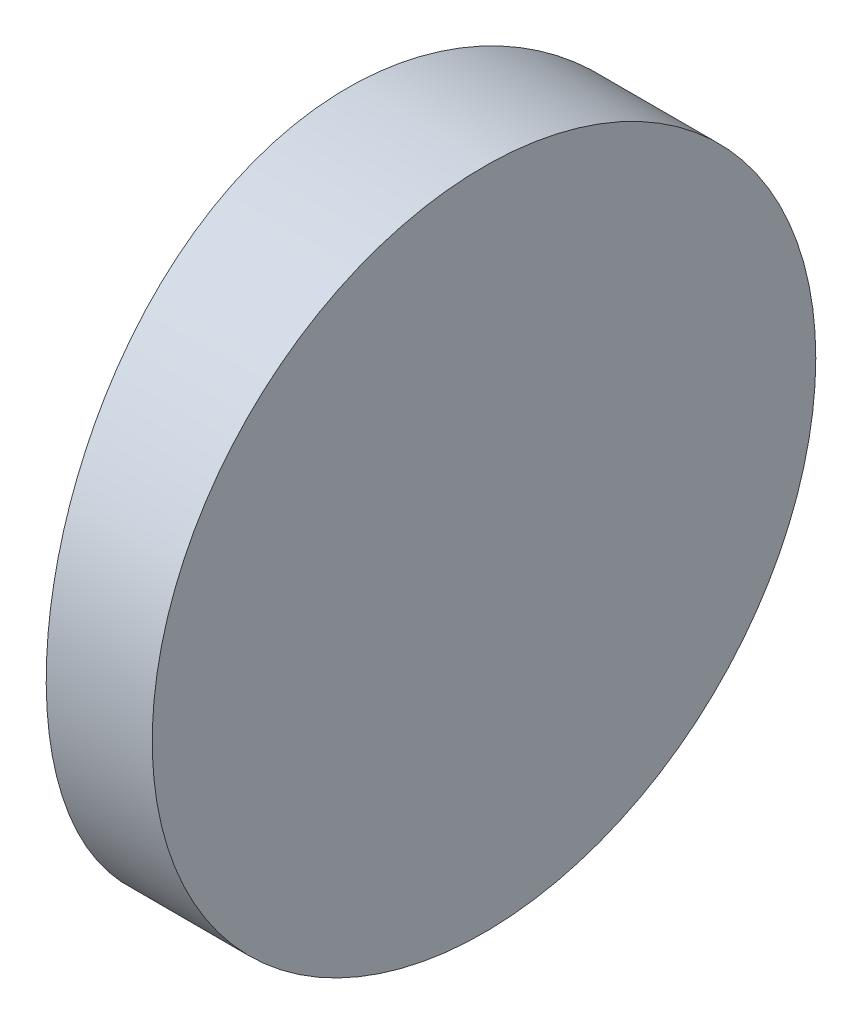
ISO-10303-21;
HEADER;
FILE_DESCRIPTION(('STEP AP214'),'2;1');
FILE_NAME('part.step','',(''),(''),'','','');
FILE_SCHEMA(('AUTOMOTIVE_DESIGN { 1 0 10303 214 1 1 1 1 }'));
ENDSEC;
DATA;
#1=APPLICATION_CONTEXT('core data for automotive mechanical design processes');
#2=APPLICATION_PROTOCOL_DEFINITION('international standard','automotive_design',2000,#1);
#3=PRODUCT_CONTEXT('',#1,'mechanical');
#4=PRODUCT('Part','Part','',(#3));
#5=PRODUCT_RELATED_PRODUCT_CATEGORY('part','',(#4));
#6=PRODUCT_DEFINITION_FORMATION('','',#4);
#7=PRODUCT_DEFINITION_CONTEXT('part definition',#1,'design');
#8=PRODUCT_DEFINITION('design','',#6,#7);
#9=PRODUCT_DEFINITION_SHAPE('','',#8);
#10=(LENGTH_UNIT() NAMED_UNIT(*) SI_UNIT(.MILLI.,.METRE.));
#11=(NAMED_UNIT(*) PLANE_ANGLE_UNIT() SI_UNIT($,.RADIAN.));
#12=(NAMED_UNIT(*) SI_UNIT($,.STERADIAN.) SOLID_ANGLE_UNIT());
#13=UNCERTAINTY_MEASURE_WITH_UNIT(LENGTH_MEASURE(1.E-05),#10,'distance_accuracy_value','');
#14=(GEOMETRIC_REPRESENTATION_CONTEXT(3) GLOBAL_UNCERTAINTY_ASSIGNED_CONTEXT((#13)) GLOBAL_UNIT_ASSIGNED_CONTEXT((#10,
#11,#12)) REPRESENTATION_CONTEXT('',''));
#15=CARTESIAN_POINT('',(0.,0.,0.));
#16=DIRECTION('',(0.,0.,1.));
#17=DIRECTION('',(1.,0.,0.));
#18=AXIS2_PLACEMENT_3D('',#15,#16,#17);
#19=CARTESIAN_POINT('',(4.35520433485127,12.5,0.));
#20=DIRECTION('',(0.,-1.,0.));
#21=DIRECTION('',(0.,0.,-1.));
#22=AXIS2_PLACEMENT_3D('',#19,#20,#21);
#23=CYLINDRICAL_SURFACE('',#22,34.3800000000001);
#24=CARTESIAN_POINT('',(-30.0247956651488,0.,0.));
#25=CARTESIAN_POINT('',(-30.0247966754529,-2.16526707216863E-06,-0.174032121800616));
#26=CARTESIAN_POINT('',(-30.0234716706296,0.00727166692268643,-0.348033690944135));
#27=CARTESIAN_POINT('',(-30.0182106574276,0.0363076365460484,-0.694838989285588));
#28=CARTESIAN_POINT('',(-30.0142740651669,0.0580730139107357,-0.867642441884459));
#29=CARTESIAN_POINT('',(-30.0038946533762,0.115948332313473,-1.21087872715717));
#30=CARTESIAN_POINT('',(-29.9974500023495,0.152068756458872,-1.38130973294414));
#31=CARTESIAN_POINT('',(-29.9822323237955,0.23838950915103,-1.71852880902783));
#32=CARTESIAN_POINT('',(-29.9734584366653,0.288595036184187,-1.88531550975134));
#33=CARTESIAN_POINT('',(-29.9538405518825,0.402623799255349,-2.21379261973112));
#34=CARTESIAN_POINT('',(-29.9429992927213,0.466429033805725,-2.37548944470005));
#35=CARTESIAN_POINT('',(-29.9195342728976,0.607250175725587,-2.69296132429321));
#36=CARTESIAN_POINT('',(-29.9069098462301,0.684271021385642,-2.84873413860882));
#37=CARTESIAN_POINT('',(-29.8802364754772,0.850901583755614,-3.15314558451637));
#38=CARTESIAN_POINT('',(-29.8661883700975,0.940503900432328,-3.30178834133201));
#39=CARTESIAN_POINT('',(-29.8370391089744,1.13174413209563,-3.59110574690427));
#40=CARTESIAN_POINT('',(-29.8219374758049,1.23338751847757,-3.73177673007921));
#41=CARTESIAN_POINT('',(-29.7909443199645,1.44905570359173,-4.00550844840688));
#42=CARTESIAN_POINT('',(-29.7750463901435,1.56319454311513,-4.13847861978909));
#43=CARTESIAN_POINT('',(-29.7430528478512,1.80216308204326,-4.39429986610319));
#44=CARTESIAN_POINT('',(-29.7269573256952,1.92698804227052,-4.51715537983779));
#45=CARTESIAN_POINT('',(-29.6949999474501,2.18661291141819,-4.75205769627394));
#46=CARTESIAN_POINT('',(-29.67913826192,2.32141970742477,-4.86409691101038));
#47=CARTESIAN_POINT('',(-29.6481119774946,2.59996367494434,-5.07645489294219));
#48=CARTESIAN_POINT('',(-29.6329471198384,2.74369748409176,-5.17677803248602));
#49=CARTESIAN_POINT('',(-29.6036175208395,3.04038236977081,-5.36582215189747));
#50=CARTESIAN_POINT('',(-29.5894620406244,3.19339958540813,-5.45444081888822));
#51=CARTESIAN_POINT('',(-29.5627070667163,3.50643985243101,-5.61841506640609));
#52=CARTESIAN_POINT('',(-29.5501069954021,3.66646027300101,-5.69377557496905));
#53=CARTESIAN_POINT('',(-29.5268368577649,3.99230413100608,-5.83065230380131));
#54=CARTESIAN_POINT('',(-29.5161652271573,4.15812273364641,-5.89217975495147));
#55=CARTESIAN_POINT('',(-29.49705850374,4.49443844016161,-6.00097855035523));
#56=CARTESIAN_POINT('',(-29.4886228646966,4.66493439014887,-6.04825337679211));
#57=CARTESIAN_POINT('',(-29.4717783258182,5.06841981588443,-6.14187845947594));
#58=CARTESIAN_POINT('',(-29.4643659423319,5.30283360074904,-6.18237901216096));
#59=CARTESIAN_POINT('',(-29.4544393592717,5.77485060915913,-6.23643807294721));
#60=CARTESIAN_POINT('',(-29.4519250767577,6.01245377862978,-6.24999703725363));
#61=CARTESIAN_POINT('',(-29.4519225386692,6.42400541758091,-6.25000217024676));
#62=CARTESIAN_POINT('',(-29.4532697770657,6.59798027831555,-6.24273054816984));
#63=CARTESIAN_POINT('',(-29.4586170461026,6.94473143297194,-6.21370362390689));
#64=CARTESIAN_POINT('',(-29.4626176705784,7.11750744984051,-6.19194507950131));
#65=CARTESIAN_POINT('',(-29.4731597847823,7.46068823321553,-6.1340884563267));
#66=CARTESIAN_POINT('',(-29.4797031382219,7.63109116523722,-6.09797985914068));
#67=CARTESIAN_POINT('',(-29.4951416617448,7.96825348377027,-6.0116882927916));
#68=CARTESIAN_POINT('',(-29.5040377009796,8.13501149904221,-5.96150012180162));
#69=CARTESIAN_POINT('',(-29.5239091085365,8.46342760203223,-5.84751325724086));
#70=CARTESIAN_POINT('',(-29.5348816717895,8.62509223040447,-5.78373291015062));
#71=CARTESIAN_POINT('',(-29.5586042044396,8.94250242573575,-5.6429675937343));
#72=CARTESIAN_POINT('',(-29.5713548380792,9.09824575284527,-5.56597768716045));
#73=CARTESIAN_POINT('',(-29.5982644567942,9.40263721903731,-5.39939524591703));
#74=CARTESIAN_POINT('',(-29.6124229309107,9.55128790353262,-5.30980727870906));
#75=CARTESIAN_POINT('',(-29.641755969186,9.84055970999452,-5.11863634783181));
#76=CARTESIAN_POINT('',(-29.6569305460109,9.98118073182725,-5.01705323462559));
#77=CARTESIAN_POINT('',(-29.6880399519737,10.2549058633713,-4.80144805538986));
#78=CARTESIAN_POINT('',(-29.7039811521704,10.3879140763228,-4.68730514185814));
#79=CARTESIAN_POINT('',(-29.7360169652237,10.6438117306277,-4.4483204393805));
#80=CARTESIAN_POINT('',(-29.7521115072655,10.7667056120484,-4.32348339467767));
#81=CARTESIAN_POINT('',(-29.7840228124085,11.0016831370688,-4.06382666333918));
#82=CARTESIAN_POINT('',(-29.7998393756431,11.1137592434572,-3.92900013057043));
#83=CARTESIAN_POINT('',(-29.8307364007761,11.3261881941602,-3.65040914334591));
#84=CARTESIAN_POINT('',(-29.8458171364066,11.4265454176248,-3.5066480585515));
#85=CARTESIAN_POINT('',(-29.8749442220342,11.6156285534217,-3.20994109758478));
#86=CARTESIAN_POINT('',(-29.888981370532,11.7042553945702,-3.05693115314029));
#87=CARTESIAN_POINT('',(-29.9154835537917,11.8682467437598,-2.74390468318712));
#88=CARTESIAN_POINT('',(-29.927949172124,11.9436161789258,-2.58389078843104));
#89=CARTESIAN_POINT('',(-29.9509497257062,12.0805112246906,-2.25806001828833));
#90=CARTESIAN_POINT('',(-29.9614862184638,12.1420480125043,-2.09224795411832));
#91=CARTESIAN_POINT('',(-29.9803373883054,12.25086569886,-1.75594687598187));
#92=CARTESIAN_POINT('',(-29.9886526065797,12.2981500702149,-1.58545901240735));
#93=CARTESIAN_POINT('',(-30.005252136405,12.3918167011583,-1.18191569936069));
#94=CARTESIAN_POINT('',(-30.0125499722774,12.4323405433149,-0.947434528036667));
#95=CARTESIAN_POINT('',(-30.022321008445,12.4864304994547,-0.475283218873991));
#96=CARTESIAN_POINT('',(-30.0247942857395,12.4999970436728,-0.237613131990956));
#97=CARTESIAN_POINT('',(-30.0247966754529,12.5000021652671,0.174032121800623));
#98=CARTESIAN_POINT('',(-30.0234716706296,12.4927283330773,0.34803369094414));
#99=CARTESIAN_POINT('',(-30.0182106574276,12.463692363454,0.694838989285593));
#100=CARTESIAN_POINT('',(-30.0142740651669,12.4419269860893,0.867642441884465));
#101=CARTESIAN_POINT('',(-30.0038946533762,12.3840516676865,1.21087872715718));
#102=CARTESIAN_POINT('',(-29.9974500023495,12.3479312435411,1.38130973294415));
#103=CARTESIAN_POINT('',(-29.9822323237955,12.261610490849,1.71852880902784));
#104=CARTESIAN_POINT('',(-29.9734584366653,12.2114049638158,1.88531550975135));
#105=CARTESIAN_POINT('',(-29.9538405518825,12.0973762007447,2.21379261973113));
#106=CARTESIAN_POINT('',(-29.9429992927213,12.0335709661943,2.37548944470005));
#107=CARTESIAN_POINT('',(-29.9195342728976,11.8927498242744,2.69296132429321));
#108=CARTESIAN_POINT('',(-29.9069098462301,11.8157289786144,2.84873413860883));
#109=CARTESIAN_POINT('',(-29.8802364754772,11.6490984162444,3.15314558451638));
#110=CARTESIAN_POINT('',(-29.8661883700975,11.5594960995677,3.30178834133202));
#111=CARTESIAN_POINT('',(-29.8370391089744,11.3682558679044,3.59110574690427));
#112=CARTESIAN_POINT('',(-29.8219374758049,11.2666124815224,3.73177673007922));
#113=CARTESIAN_POINT('',(-29.7909443199645,11.0509442964083,4.00550844840689));
#114=CARTESIAN_POINT('',(-29.7750463901435,10.9368054568849,4.13847861978909));
#115=CARTESIAN_POINT('',(-29.7430528478512,10.6978369179567,4.3942998661032));
#116=CARTESIAN_POINT('',(-29.7269573256952,10.5730119577295,4.5171553798378));
#117=CARTESIAN_POINT('',(-29.6949999474501,10.3133870885818,4.75205769627395));
#118=CARTESIAN_POINT('',(-29.67913826192,10.1785802925752,4.86409691101038));
#119=CARTESIAN_POINT('',(-29.6481119774946,9.90003632505566,5.07645489294219));
#120=CARTESIAN_POINT('',(-29.6329471198384,9.75630251590824,5.17677803248602));
#121=CARTESIAN_POINT('',(-29.6036175208395,9.45961763022919,5.36582215189748));
#122=CARTESIAN_POINT('',(-29.5894620406244,9.30660041459188,5.45444081888823));
#123=CARTESIAN_POINT('',(-29.5627070667163,8.993560147569,5.6184150664061));
#124=CARTESIAN_POINT('',(-29.5501069954021,8.833539726999,5.69377557496906));
#125=CARTESIAN_POINT('',(-29.5268368577649,8.50769586899392,5.83065230380132));
#126=CARTESIAN_POINT('',(-29.5161652271573,8.34187726635359,5.89217975495148));
#127=CARTESIAN_POINT('',(-29.49705850374,8.00556155983839,6.00097855035524));
#128=CARTESIAN_POINT('',(-29.4886228646966,7.83506560985114,6.04825337679211));
#129=CARTESIAN_POINT('',(-29.4717783258182,7.43158018411557,6.14187845947595));
#130=CARTESIAN_POINT('',(-29.4643659423319,7.19716639925096,6.18237901216097));
#131=CARTESIAN_POINT('',(-29.4544393592717,6.72514939084087,6.23643807294722));
#132=CARTESIAN_POINT('',(-29.4519250767577,6.48754622137022,6.24999703725364));
#133=CARTESIAN_POINT('',(-29.4519225386692,6.07599458241909,6.25000217024677));
#134=CARTESIAN_POINT('',(-29.4532697770657,5.90201972168446,6.24273054816985));
#135=CARTESIAN_POINT('',(-29.4586170461026,5.55526856702807,6.2137036239069));
#136=CARTESIAN_POINT('',(-29.4626176705784,5.3824925501595,6.19194507950132));
#137=CARTESIAN_POINT('',(-29.4731597847823,5.03931176678447,6.1340884563267));
#138=CARTESIAN_POINT('',(-29.4797031382219,4.86890883476278,6.09797985914069));
#139=CARTESIAN_POINT('',(-29.4951416617448,4.53174651622973,6.01168829279161));
#140=CARTESIAN_POINT('',(-29.5040377009796,4.36498850095779,5.96150012180163));
#141=CARTESIAN_POINT('',(-29.5239091085365,4.03657239796777,5.84751325724087));
#142=CARTESIAN_POINT('',(-29.5348816717895,3.87490776959553,5.78373291015063));
#143=CARTESIAN_POINT('',(-29.5586042044396,3.55749757426425,5.6429675937343));
#144=CARTESIAN_POINT('',(-29.5713548380792,3.40175424715474,5.56597768716046));
#145=CARTESIAN_POINT('',(-29.5982644567942,3.09736278096269,5.39939524591704));
#146=CARTESIAN_POINT('',(-29.6124229309107,2.94871209646737,5.30980727870907));
#147=CARTESIAN_POINT('',(-29.641755969186,2.65944029000548,5.11863634783181));
#148=CARTESIAN_POINT('',(-29.6569305460109,2.51881926817275,5.0170532346256));
#149=CARTESIAN_POINT('',(-29.6880399519737,2.24509413662871,4.80144805538986));
#150=CARTESIAN_POINT('',(-29.7039811521704,2.11208592367721,4.68730514185814));
#151=CARTESIAN_POINT('',(-29.7360169652237,1.85618826937231,4.44832043938051));
#152=CARTESIAN_POINT('',(-29.7521115072654,1.73329438795165,4.32348339467768));
#153=CARTESIAN_POINT('',(-29.7840228124085,1.49831686293123,4.06382666333918));
#154=CARTESIAN_POINT('',(-29.7998393756431,1.38624075654276,3.92900013057043));
#155=CARTESIAN_POINT('',(-29.8307364007761,1.1738118058398,3.65040914334591));
#156=CARTESIAN_POINT('',(-29.8458171364066,1.07345458237519,3.50664805855151));
#157=CARTESIAN_POINT('',(-29.8749442220342,0.884371446578285,3.20994109758479));
#158=CARTESIAN_POINT('',(-29.888981370532,0.795744605429799,3.05693115314029));
#159=CARTESIAN_POINT('',(-29.9154835537917,0.631753256240155,2.74390468318713));
#160=CARTESIAN_POINT('',(-29.927949172124,0.556383821074242,2.58389078843105));
#161=CARTESIAN_POINT('',(-29.9509497257062,0.419488775309376,2.25806001828834));
#162=CARTESIAN_POINT('',(-29.9614862184638,0.357951987495655,2.09224795411833));
#163=CARTESIAN_POINT('',(-29.9803373883054,0.249134301140028,1.75594687598188));
#164=CARTESIAN_POINT('',(-29.9886526065797,0.201849929785077,1.58545901240736));
#165=CARTESIAN_POINT('',(-30.005252136405,0.108183298841687,1.18191569936069));
#166=CARTESIAN_POINT('',(-30.0125499722774,0.0676594566851006,0.947434528036671));
#167=CARTESIAN_POINT('',(-30.022321008445,0.0135695005453032,0.475283218873996));
#168=CARTESIAN_POINT('',(-30.0247942857395,2.95632717277509E-06,0.237613131990962));
#169=CARTESIAN_POINT('',(-30.0247956651488,0.,0.));
#170=B_SPLINE_CURVE_WITH_KNOTS('',3,(#24,#25,#26,#27,#28,#29,#30,#31,#32,#33,#34,#35,#36,#37,
#38,#39,#40,#41,#42,#43,#44,#45,#46,#47,#48,#49,#50,#51,#52,#53,#54,#55,#56,#57,#58,#59,#60,#61,
#62,#63,#64,#65,#66,#67,#68,#69,#70,#71,#72,#73,#74,#75,#76,#77,#78,#79,#80,#81,#82,#83,#84,#85,
#86,#87,#88,#89,#90,#91,#92,#93,#94,#95,#96,#97,#98,#99,#100,#101,#102,#103,#104,#105,#106,#107,
#108,#109,#110,#111,#112,#113,#114,#115,#116,#117,#118,#119,#120,#121,#122,#123,#124,#125,#126,
#127,#128,#129,#130,#131,#132,#133,#134,#135,#136,#137,#138,#139,#140,#141,#142,#143,#144,#145,
#146,#147,#148,#149,#150,#151,#152,#153,#154,#155,#156,#157,#158,#159,#160,#161,#162,#163,#164,
#165,#166,#167,#168,#169),.UNSPECIFIED.,.T.,.F.,(4,2,2,2,2,2,2,2,2,2,2,2,2,2,2,2,2,2,2,2,2,2,2,
2,2,2,2,2,2,2,2,2,2,2,2,2,2,2,2,2,2,2,2,2,2,2,2,2,2,2,2,2,2,2,2,2,2,2,2,2,2,2,2,2,2,2,2,2,2,2,2,
2,4),(0.,0.521886952674787,1.04389062484225,1.56627620489794,2.08885483962936,2.61074600283116,
3.13283260802091,3.65461341432718,4.17663223099093,4.70389096694898,5.2309170689205,
5.75831024933193,6.28550597745135,6.81704179632193,7.34837962484498,7.87928449659319,
8.41005955302199,9.12242426208291,9.83477690848312,10.3565836498691,10.8785072125454,
11.40081404664,11.9233141064725,12.4451133220056,12.9671079934612,13.4889138999116,
14.010726312118,14.5380906676351,15.0652222679371,15.5927185317983,16.1200170440414,
16.6515179202984,17.1828208445714,17.7136929036584,18.2444355031156,18.9570003519099,
19.6695538281718,20.1914407808466,20.7134444530141,21.2358300330698,21.7584086678012,
22.280299831003,22.8023864361927,23.324167242499,23.8461860591628,24.3734447951208,
24.9004708970923,25.4278640775038,25.9550598056232,26.4865956244937,27.0179334530168,
27.548838324765,28.0796133811938,28.7919780902547,29.5043307366549,30.0261374780409,
30.5480610407172,31.0703678748119,31.5928679346443,32.1146671501774,32.6366618216331,
33.1584677280835,33.6802801402899,34.2076444958069,34.7347760961089,35.2622723599701,
35.7895708722132,36.3210717484703,36.8523746727432,37.3832467318302,37.9139893312874,
38.6265541800817,39.3391076563436),.UNSPECIFIED.);
#171=CARTESIAN_POINT('',(-30.0247956651488,0.,0.));
#172=VERTEX_POINT('',#171);
#173=EDGE_CURVE('E10',#172,#172,#170,.T.);
#174=ORIENTED_EDGE('',*,*,#173,.F.);
#175=EDGE_LOOP('',(#174));
#176=FACE_BOUND('',#175,.T.);
#177=ADVANCED_FACE('F35',(#176),#23,.T.);
#178=CARTESIAN_POINT('',(-27.4547956651487,12.5,-6.25));
#179=DIRECTION('',(1.,0.,0.));
#180=DIRECTION('',(0.,0.,-1.));
#181=AXIS2_PLACEMENT_3D('',#178,#179,#180);
#182=PLANE('',#181);
#183=CARTESIAN_POINT('',(-27.4547956651487,6.25,0.));
#184=DIRECTION('',(1.,0.,0.));
#185=DIRECTION('',(0.,0.,-1.));
#186=AXIS2_PLACEMENT_3D('',#183,#184,#185);
#187=CIRCLE('',#186,6.25);
#188=CARTESIAN_POINT('',(-27.4547956651487,6.25,-6.25));
#189=VERTEX_POINT('',#188);
#190=EDGE_CURVE('E45',#189,#189,#187,.T.);
#191=ORIENTED_EDGE('',*,*,#190,.T.);
#192=EDGE_LOOP('',(#191));
#193=FACE_BOUND('',#192,.T.);
#194=ADVANCED_FACE('F37',(#193),#182,.T.);
#195=CARTESIAN_POINT('',(-40.1547956651487,6.25,0.));
#196=DIRECTION('',(1.,0.,0.));
#197=DIRECTION('',(0.,0.,-1.));
#198=AXIS2_PLACEMENT_3D('',#195,#196,#197);
#199=CYLINDRICAL_SURFACE('',#198,6.25);
#200=ORIENTED_EDGE('',*,*,#190,.F.);
#201=EDGE_LOOP('',(#200));
#202=FACE_BOUND('',#201,.T.);
#203=ORIENTED_EDGE('',*,*,#173,.T.);
#204=EDGE_LOOP('',(#203));
#205=FACE_BOUND('',#204,.T.);
#206=ADVANCED_FACE('F52',(#202,#205),#199,.T.);
#207=CLOSED_SHELL('',(#177,#194,#206));
#208=MANIFOLD_SOLID_BREP('B2',#207);
#209=ADVANCED_BREP_SHAPE_REPRESENTATION('',(#18,#208),#14);
#210=SHAPE_DEFINITION_REPRESENTATION(#9,#209);
ENDSEC;
END-ISO-10303-21;
